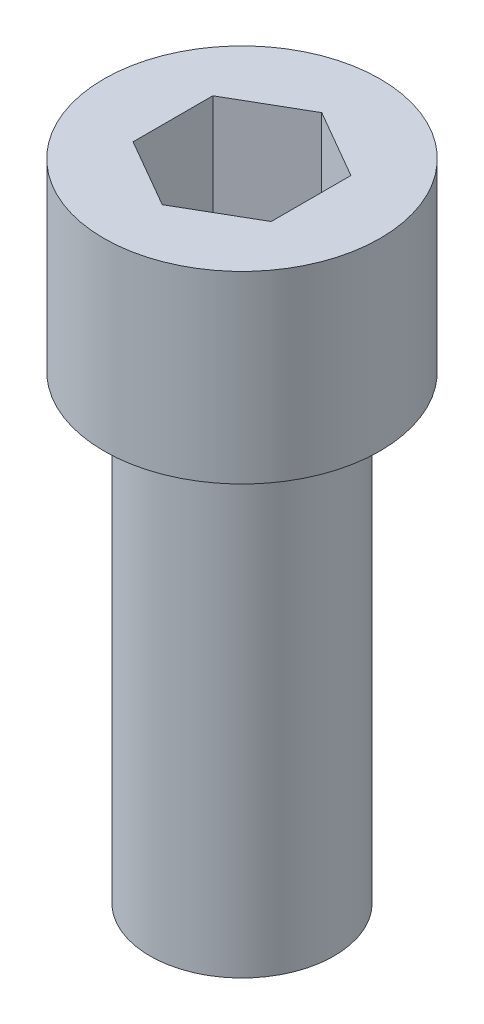
ISO-10303-21;
HEADER;
FILE_DESCRIPTION(('STEP AP214'),'2;1');
FILE_NAME('part.step','',(''),(''),'','','');
FILE_SCHEMA(('AUTOMOTIVE_DESIGN { 1 0 10303 214 1 1 1 1 }'));
ENDSEC;
DATA;
#1=APPLICATION_CONTEXT('core data for automotive mechanical design processes');
#2=APPLICATION_PROTOCOL_DEFINITION('international standard','automotive_design',2000,#1);
#3=PRODUCT_CONTEXT('',#1,'mechanical');
#4=PRODUCT('Part','Part','',(#3));
#5=PRODUCT_RELATED_PRODUCT_CATEGORY('part','',(#4));
#6=PRODUCT_DEFINITION_FORMATION('','',#4);
#7=PRODUCT_DEFINITION_CONTEXT('part definition',#1,'design');
#8=PRODUCT_DEFINITION('design','',#6,#7);
#9=PRODUCT_DEFINITION_SHAPE('','',#8);
#10=(LENGTH_UNIT() NAMED_UNIT(*) SI_UNIT(.MILLI.,.METRE.));
#11=(NAMED_UNIT(*) PLANE_ANGLE_UNIT() SI_UNIT($,.RADIAN.));
#12=(NAMED_UNIT(*) SI_UNIT($,.STERADIAN.) SOLID_ANGLE_UNIT());
#13=UNCERTAINTY_MEASURE_WITH_UNIT(LENGTH_MEASURE(1.E-05),#10,'distance_accuracy_value','');
#14=(GEOMETRIC_REPRESENTATION_CONTEXT(3) GLOBAL_UNCERTAINTY_ASSIGNED_CONTEXT((#13)) GLOBAL_UNIT_ASSIGNED_CONTEXT((#10,
#11,#12)) REPRESENTATION_CONTEXT('',''));
#15=CARTESIAN_POINT('',(0.,0.,0.));
#16=DIRECTION('',(0.,0.,1.));
#17=DIRECTION('',(1.,0.,0.));
#18=AXIS2_PLACEMENT_3D('',#15,#16,#17);
#19=CARTESIAN_POINT('',(-3.175,-15.875,-3.2385));
#20=DIRECTION('',(0.,-1.,0.));
#21=DIRECTION('',(1.,0.,0.));
#22=AXIS2_PLACEMENT_3D('',#19,#20,#21);
#23=PLANE('',#22);
#24=CARTESIAN_POINT('',(0.,-15.875,0.));
#25=DIRECTION('',(0.,-1.,0.));
#26=DIRECTION('',(0.,0.,-1.));
#27=AXIS2_PLACEMENT_3D('',#24,#25,#26);
#28=CIRCLE('',#27,3.175);
#29=CARTESIAN_POINT('',(0.,-15.875,-3.175));
#30=VERTEX_POINT('',#29);
#31=EDGE_CURVE('E20',#30,#30,#28,.F.);
#32=ORIENTED_EDGE('',*,*,#31,.F.);
#33=EDGE_LOOP('',(#32));
#34=FACE_BOUND('',#33,.T.);
#35=ADVANCED_FACE('F16',(#34),#23,.T.);
#36=CARTESIAN_POINT('',(-2.38125,1.5875,-2.7496306570156));
#37=DIRECTION('',(0.,1.,0.));
#38=DIRECTION('',(0.,0.,1.));
#39=AXIS2_PLACEMENT_3D('',#36,#37,#38);
#40=PLANE('',#39);
#41=DIRECTION('',(0.,0.,1.));
#42=VECTOR('',#41,1.);
#43=CARTESIAN_POINT('',(2.38125,1.5875,0.));
#44=LINE('',#43,#42);
#45=CARTESIAN_POINT('',(2.38125,1.5875,-1.3748153285078));
#46=VERTEX_POINT('',#45);
#47=CARTESIAN_POINT('',(2.38125,1.5875,1.3748153285078));
#48=VERTEX_POINT('',#47);
#49=EDGE_CURVE('E75',#46,#48,#44,.T.);
#50=ORIENTED_EDGE('',*,*,#49,.F.);
#51=DIRECTION('',(0.866025403784438,0.,0.500000000000001));
#52=VECTOR('',#51,1.);
#53=CARTESIAN_POINT('',(1.190625,1.5875,-2.0622229927617));
#54=LINE('',#53,#52);
#55=CARTESIAN_POINT('',(-2.4999999549645E-09,1.5875,-2.74963065557222));
#56=VERTEX_POINT('',#55);
#57=EDGE_CURVE('E77',#56,#46,#54,.T.);
#58=ORIENTED_EDGE('',*,*,#57,.F.);
#59=DIRECTION('',(0.866025403784438,0.,-0.500000000000001));
#60=VECTOR('',#59,1.);
#61=CARTESIAN_POINT('',(-1.190625,1.5875,-2.0622229927617));
#62=LINE('',#61,#60);
#63=CARTESIAN_POINT('',(-2.38125,1.5875,-1.3748153285078));
#64=VERTEX_POINT('',#63);
#65=EDGE_CURVE('E64',#64,#56,#62,.T.);
#66=ORIENTED_EDGE('',*,*,#65,.F.);
#67=DIRECTION('',(0.,0.,-1.));
#68=VECTOR('',#67,1.);
#69=CARTESIAN_POINT('',(-2.38125,1.5875,0.));
#70=LINE('',#69,#68);
#71=CARTESIAN_POINT('',(-2.38125,1.5875,1.3748153285078));
#72=VERTEX_POINT('',#71);
#73=EDGE_CURVE('E123',#72,#64,#70,.T.);
#74=ORIENTED_EDGE('',*,*,#73,.F.);
#75=DIRECTION('',(-0.866025403784438,0.,-0.500000000000001));
#76=VECTOR('',#75,1.);
#77=CARTESIAN_POINT('',(-1.190625,1.5875,2.0622229927617));
#78=LINE('',#77,#76);
#79=CARTESIAN_POINT('',(-2.4999999549645E-09,1.5875,2.74963065557223));
#80=VERTEX_POINT('',#79);
#81=EDGE_CURVE('E106',#80,#72,#78,.T.);
#82=ORIENTED_EDGE('',*,*,#81,.F.);
#83=DIRECTION('',(-0.866025403784438,0.,0.500000000000001));
#84=VECTOR('',#83,1.);
#85=CARTESIAN_POINT('',(1.190625,1.5875,2.0622229927617));
#86=LINE('',#85,#84);
#87=EDGE_CURVE('E99',#48,#80,#86,.T.);
#88=ORIENTED_EDGE('',*,*,#87,.F.);
#89=EDGE_LOOP('',(#50,#58,#66,#74,#82,#88));
#90=FACE_BOUND('',#89,.T.);
#91=ADVANCED_FACE('F78',(#90),#40,.T.);
#92=CARTESIAN_POINT('',(0.,0.,0.));
#93=DIRECTION('',(0.,-1.,0.));
#94=DIRECTION('',(0.,0.,-1.));
#95=AXIS2_PLACEMENT_3D('',#92,#93,#94);
#96=CYLINDRICAL_SURFACE('',#95,3.175);
#97=CARTESIAN_POINT('',(0.,0.,0.));
#98=DIRECTION('',(0.,-1.,0.));
#99=DIRECTION('',(0.,0.,-1.));
#100=AXIS2_PLACEMENT_3D('',#97,#98,#99);
#101=CIRCLE('',#100,3.175);
#102=CARTESIAN_POINT('',(0.,0.,-3.175));
#103=VERTEX_POINT('',#102);
#104=EDGE_CURVE('E117',#103,#103,#101,.F.);
#105=ORIENTED_EDGE('',*,*,#104,.F.);
#106=EDGE_LOOP('',(#105));
#107=FACE_BOUND('',#106,.T.);
#108=ORIENTED_EDGE('',*,*,#31,.T.);
#109=EDGE_LOOP('',(#108));
#110=FACE_BOUND('',#109,.T.);
#111=ADVANCED_FACE('F224',(#107,#110),#96,.T.);
#112=CARTESIAN_POINT('',(0.,6.35,-2.7496306570156));
#113=DIRECTION('',(0.500000000000001,0.,0.866025403784438));
#114=DIRECTION('',(-0.866025403784438,0.,0.500000000000001));
#115=AXIS2_PLACEMENT_3D('',#112,#113,#114);
#116=PLANE('',#115);
#117=DIRECTION('',(0.866025403784438,0.,-0.500000000000001));
#118=VECTOR('',#117,1.);
#119=CARTESIAN_POINT('',(-2.38125,6.35,-1.3748153285078));
#120=LINE('',#119,#118);
#121=CARTESIAN_POINT('',(-2.38125,6.35,-1.3748153285078));
#122=VERTEX_POINT('',#121);
#123=CARTESIAN_POINT('',(0.,6.35,-2.7496306570156));
#124=VERTEX_POINT('',#123);
#125=EDGE_CURVE('E55',#122,#124,#120,.T.);
#126=ORIENTED_EDGE('',*,*,#125,.F.);
#127=DIRECTION('',(0.,1.,0.));
#128=VECTOR('',#127,1.);
#129=CARTESIAN_POINT('',(-2.38125,3.96875,-1.3748153285078));
#130=LINE('',#129,#128);
#131=EDGE_CURVE('E86',#64,#122,#130,.T.);
#132=ORIENTED_EDGE('',*,*,#131,.F.);
#133=ORIENTED_EDGE('',*,*,#65,.T.);
#134=DIRECTION('',(0.,-1.,0.));
#135=VECTOR('',#134,1.);
#136=CARTESIAN_POINT('',(0.,3.96875,-2.7496306570156));
#137=LINE('',#136,#135);
#138=EDGE_CURVE('E82',#124,#56,#137,.T.);
#139=ORIENTED_EDGE('',*,*,#138,.F.);
#140=EDGE_LOOP('',(#126,#132,#133,#139));
#141=FACE_BOUND('',#140,.T.);
#142=ADVANCED_FACE('F84',(#141),#116,.T.);
#143=CARTESIAN_POINT('',(2.38125,6.35,-1.3748153285078));
#144=DIRECTION('',(-0.500000000000001,0.,0.866025403784438));
#145=DIRECTION('',(-0.866025403784438,0.,-0.500000000000001));
#146=AXIS2_PLACEMENT_3D('',#143,#144,#145);
#147=PLANE('',#146);
#148=DIRECTION('',(0.866025403784438,0.,0.500000000000001));
#149=VECTOR('',#148,1.);
#150=CARTESIAN_POINT('',(0.,6.35,-2.7496306570156));
#151=LINE('',#150,#149);
#152=CARTESIAN_POINT('',(2.38125,6.35,-1.3748153285078));
#153=VERTEX_POINT('',#152);
#154=EDGE_CURVE('E91',#124,#153,#151,.T.);
#155=ORIENTED_EDGE('',*,*,#154,.F.);
#156=ORIENTED_EDGE('',*,*,#138,.T.);
#157=ORIENTED_EDGE('',*,*,#57,.T.);
#158=DIRECTION('',(0.,-1.,0.));
#159=VECTOR('',#158,1.);
#160=CARTESIAN_POINT('',(2.38125,3.96875,-1.3748153285078));
#161=LINE('',#160,#159);
#162=EDGE_CURVE('E93',#153,#46,#161,.T.);
#163=ORIENTED_EDGE('',*,*,#162,.F.);
#164=EDGE_LOOP('',(#155,#156,#157,#163));
#165=FACE_BOUND('',#164,.T.);
#166=ADVANCED_FACE('F89',(#165),#147,.T.);
#167=CARTESIAN_POINT('',(2.38125,6.35,1.3748153285078));
#168=DIRECTION('',(-1.,0.,0.));
#169=DIRECTION('',(0.,0.,-1.));
#170=AXIS2_PLACEMENT_3D('',#167,#168,#169);
#171=PLANE('',#170);
#172=DIRECTION('',(0.,0.,1.));
#173=VECTOR('',#172,1.);
#174=CARTESIAN_POINT('',(2.38125,6.35,0.));
#175=LINE('',#174,#173);
#176=CARTESIAN_POINT('',(2.38125,6.35,1.3748153285078));
#177=VERTEX_POINT('',#176);
#178=EDGE_CURVE('E100',#153,#177,#175,.T.);
#179=ORIENTED_EDGE('',*,*,#178,.F.);
#180=ORIENTED_EDGE('',*,*,#162,.T.);
#181=ORIENTED_EDGE('',*,*,#49,.T.);
#182=DIRECTION('',(0.,-1.,0.));
#183=VECTOR('',#182,1.);
#184=CARTESIAN_POINT('',(2.38125,3.96875,1.3748153285078));
#185=LINE('',#184,#183);
#186=EDGE_CURVE('E104',#177,#48,#185,.T.);
#187=ORIENTED_EDGE('',*,*,#186,.F.);
#188=EDGE_LOOP('',(#179,#180,#181,#187));
#189=FACE_BOUND('',#188,.T.);
#190=ADVANCED_FACE('F141',(#189),#171,.T.);
#191=CARTESIAN_POINT('',(0.,6.35,2.7496306570156));
#192=DIRECTION('',(-0.500000000000001,0.,-0.866025403784438));
#193=DIRECTION('',(0.866025403784438,0.,-0.500000000000001));
#194=AXIS2_PLACEMENT_3D('',#191,#192,#193);
#195=PLANE('',#194);
#196=DIRECTION('',(-0.866025403784438,0.,0.500000000000001));
#197=VECTOR('',#196,1.);
#198=CARTESIAN_POINT('',(2.38125,6.35,1.3748153285078));
#199=LINE('',#198,#197);
#200=CARTESIAN_POINT('',(0.,6.35,2.7496306570156));
#201=VERTEX_POINT('',#200);
#202=EDGE_CURVE('E103',#177,#201,#199,.T.);
#203=ORIENTED_EDGE('',*,*,#202,.F.);
#204=ORIENTED_EDGE('',*,*,#186,.T.);
#205=ORIENTED_EDGE('',*,*,#87,.T.);
#206=DIRECTION('',(0.,-1.,0.));
#207=VECTOR('',#206,1.);
#208=CARTESIAN_POINT('',(0.,3.96875,2.7496306570156));
#209=LINE('',#208,#207);
#210=EDGE_CURVE('E125',#201,#80,#209,.T.);
#211=ORIENTED_EDGE('',*,*,#210,.F.);
#212=EDGE_LOOP('',(#203,#204,#205,#211));
#213=FACE_BOUND('',#212,.T.);
#214=ADVANCED_FACE('F137',(#213),#195,.T.);
#215=CARTESIAN_POINT('',(-2.38125,6.35,1.3748153285078));
#216=DIRECTION('',(0.500000000000001,0.,-0.866025403784438));
#217=DIRECTION('',(0.866025403784438,0.,0.500000000000001));
#218=AXIS2_PLACEMENT_3D('',#215,#216,#217);
#219=PLANE('',#218);
#220=DIRECTION('',(-0.866025403784438,0.,-0.500000000000001));
#221=VECTOR('',#220,1.);
#222=CARTESIAN_POINT('',(0.,6.35,2.7496306570156));
#223=LINE('',#222,#221);
#224=CARTESIAN_POINT('',(-2.38125,6.35,1.3748153285078));
#225=VERTEX_POINT('',#224);
#226=EDGE_CURVE('E111',#201,#225,#223,.T.);
#227=ORIENTED_EDGE('',*,*,#226,.F.);
#228=ORIENTED_EDGE('',*,*,#210,.T.);
#229=ORIENTED_EDGE('',*,*,#81,.T.);
#230=DIRECTION('',(0.,-1.,0.));
#231=VECTOR('',#230,1.);
#232=CARTESIAN_POINT('',(-2.38125,3.96875,1.3748153285078));
#233=LINE('',#232,#231);
#234=EDGE_CURVE('E35',#225,#72,#233,.T.);
#235=ORIENTED_EDGE('',*,*,#234,.F.);
#236=EDGE_LOOP('',(#227,#228,#229,#235));
#237=FACE_BOUND('',#236,.T.);
#238=ADVANCED_FACE('F138',(#237),#219,.T.);
#239=CARTESIAN_POINT('',(-2.38125,6.35,-1.3748153285078));
#240=DIRECTION('',(1.,0.,0.));
#241=DIRECTION('',(0.,0.,1.));
#242=AXIS2_PLACEMENT_3D('',#239,#240,#241);
#243=PLANE('',#242);
#244=DIRECTION('',(0.,0.,-1.));
#245=VECTOR('',#244,1.);
#246=CARTESIAN_POINT('',(-2.38125,6.35,0.));
#247=LINE('',#246,#245);
#248=EDGE_CURVE('E110',#225,#122,#247,.T.);
#249=ORIENTED_EDGE('',*,*,#248,.F.);
#250=ORIENTED_EDGE('',*,*,#234,.T.);
#251=ORIENTED_EDGE('',*,*,#73,.T.);
#252=ORIENTED_EDGE('',*,*,#131,.T.);
#253=EDGE_LOOP('',(#249,#250,#251,#252));
#254=FACE_BOUND('',#253,.T.);
#255=ADVANCED_FACE('F129',(#254),#243,.T.);
#256=CARTESIAN_POINT('',(-4.7625,0.,-4.85775));
#257=DIRECTION('',(0.,-1.,0.));
#258=DIRECTION('',(1.,0.,0.));
#259=AXIS2_PLACEMENT_3D('',#256,#257,#258);
#260=PLANE('',#259);
#261=ORIENTED_EDGE('',*,*,#104,.T.);
#262=EDGE_LOOP('',(#261));
#263=FACE_BOUND('',#262,.T.);
#264=CARTESIAN_POINT('',(0.,0.,0.));
#265=DIRECTION('',(0.,-1.,0.));
#266=DIRECTION('',(0.,0.,-1.));
#267=AXIS2_PLACEMENT_3D('',#264,#265,#266);
#268=CIRCLE('',#267,4.7625);
#269=CARTESIAN_POINT('',(0.,0.,-4.7625));
#270=VERTEX_POINT('',#269);
#271=EDGE_CURVE('E26',#270,#270,#268,.F.);
#272=ORIENTED_EDGE('',*,*,#271,.F.);
#273=EDGE_LOOP('',(#272));
#274=FACE_BOUND('',#273,.T.);
#275=ADVANCED_FACE('F156',(#263,#274),#260,.T.);
#276=CARTESIAN_POINT('',(4.7625,6.35,-4.85775));
#277=DIRECTION('',(0.,1.,0.));
#278=DIRECTION('',(-1.,0.,0.));
#279=AXIS2_PLACEMENT_3D('',#276,#277,#278);
#280=PLANE('',#279);
#281=CARTESIAN_POINT('',(0.,6.35,0.));
#282=DIRECTION('',(0.,-1.,0.));
#283=DIRECTION('',(0.,0.,-1.));
#284=AXIS2_PLACEMENT_3D('',#281,#282,#283);
#285=CIRCLE('',#284,4.7625);
#286=CARTESIAN_POINT('',(0.,6.35,-4.7625));
#287=VERTEX_POINT('',#286);
#288=EDGE_CURVE('E10',#287,#287,#285,.T.);
#289=ORIENTED_EDGE('',*,*,#288,.F.);
#290=EDGE_LOOP('',(#289));
#291=FACE_BOUND('',#290,.T.);
#292=ORIENTED_EDGE('',*,*,#226,.T.);
#293=ORIENTED_EDGE('',*,*,#248,.T.);
#294=ORIENTED_EDGE('',*,*,#125,.T.);
#295=ORIENTED_EDGE('',*,*,#154,.T.);
#296=ORIENTED_EDGE('',*,*,#178,.T.);
#297=ORIENTED_EDGE('',*,*,#202,.T.);
#298=EDGE_LOOP('',(#292,#293,#294,#295,#296,#297));
#299=FACE_BOUND('',#298,.T.);
#300=ADVANCED_FACE('F128',(#291,#299),#280,.T.);
#301=CARTESIAN_POINT('',(0.,6.35,0.));
#302=DIRECTION('',(0.,-1.,0.));
#303=DIRECTION('',(0.,0.,-1.));
#304=AXIS2_PLACEMENT_3D('',#301,#302,#303);
#305=CYLINDRICAL_SURFACE('',#304,4.7625);
#306=ORIENTED_EDGE('',*,*,#271,.T.);
#307=EDGE_LOOP('',(#306));
#308=FACE_BOUND('',#307,.T.);
#309=ORIENTED_EDGE('',*,*,#288,.T.);
#310=EDGE_LOOP('',(#309));
#311=FACE_BOUND('',#310,.T.);
#312=ADVANCED_FACE('F18',(#308,#311),#305,.T.);
#313=CLOSED_SHELL('',(#35,#91,#111,#142,#166,#190,#214,#238,#255,#275,#300,#312));
#314=MANIFOLD_SOLID_BREP('B1',#313);
#315=ADVANCED_BREP_SHAPE_REPRESENTATION('',(#18,#314),#14);
#316=SHAPE_DEFINITION_REPRESENTATION(#9,#315);
ENDSEC;
END-ISO-10303-21;
